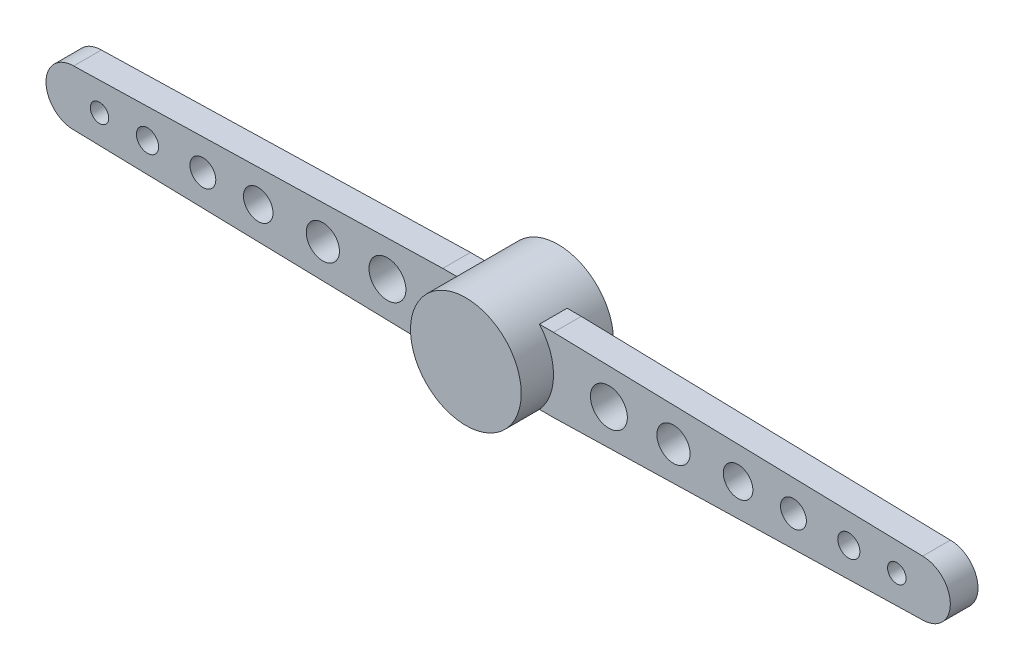
ISO-10303-21;
HEADER;
FILE_DESCRIPTION(('STEP AP214'),'2;1');
FILE_NAME('part.step','',(''),(''),'','','');
FILE_SCHEMA(('AUTOMOTIVE_DESIGN { 1 0 10303 214 1 1 1 1 }'));
ENDSEC;
DATA;
#1=APPLICATION_CONTEXT('core data for automotive mechanical design processes');
#2=APPLICATION_PROTOCOL_DEFINITION('international standard','automotive_design',2000,#1);
#3=PRODUCT_CONTEXT('',#1,'mechanical');
#4=PRODUCT('Part','Part','',(#3));
#5=PRODUCT_RELATED_PRODUCT_CATEGORY('part','',(#4));
#6=PRODUCT_DEFINITION_FORMATION('','',#4);
#7=PRODUCT_DEFINITION_CONTEXT('part definition',#1,'design');
#8=PRODUCT_DEFINITION('design','',#6,#7);
#9=PRODUCT_DEFINITION_SHAPE('','',#8);
#10=(LENGTH_UNIT() NAMED_UNIT(*) SI_UNIT(.MILLI.,.METRE.));
#11=(NAMED_UNIT(*) PLANE_ANGLE_UNIT() SI_UNIT($,.RADIAN.));
#12=(NAMED_UNIT(*) SI_UNIT($,.STERADIAN.) SOLID_ANGLE_UNIT());
#13=UNCERTAINTY_MEASURE_WITH_UNIT(LENGTH_MEASURE(1.E-05),#10,'distance_accuracy_value','');
#14=(GEOMETRIC_REPRESENTATION_CONTEXT(3) GLOBAL_UNCERTAINTY_ASSIGNED_CONTEXT((#13)) GLOBAL_UNIT_ASSIGNED_CONTEXT((#10,
#11,#12)) REPRESENTATION_CONTEXT('',''));
#15=CARTESIAN_POINT('',(0.,0.,0.));
#16=DIRECTION('',(0.,0.,1.));
#17=DIRECTION('',(1.,0.,0.));
#18=AXIS2_PLACEMENT_3D('',#15,#16,#17);
#19=CARTESIAN_POINT('',(0.,0.,2.5));
#20=DIRECTION('',(0.,0.,-1.));
#21=DIRECTION('',(-1.,0.,0.));
#22=AXIS2_PLACEMENT_3D('',#19,#20,#21);
#23=CYLINDRICAL_SURFACE('',#22,1.5);
#24=CARTESIAN_POINT('',(0.,0.,0.));
#25=DIRECTION('',(0.,0.,1.));
#26=DIRECTION('',(1.,0.,0.));
#27=AXIS2_PLACEMENT_3D('',#24,#25,#26);
#28=CIRCLE('',#27,1.5);
#29=CARTESIAN_POINT('',(1.5,0.,0.));
#30=VERTEX_POINT('',#29);
#31=EDGE_CURVE('E182',#30,#30,#28,.T.);
#32=ORIENTED_EDGE('',*,*,#31,.T.);
#33=EDGE_LOOP('',(#32));
#34=FACE_BOUND('',#33,.T.);
#35=CARTESIAN_POINT('',(0.,0.,2.5));
#36=DIRECTION('',(0.,0.,1.));
#37=DIRECTION('',(1.,0.,0.));
#38=AXIS2_PLACEMENT_3D('',#35,#36,#37);
#39=CIRCLE('',#38,1.5);
#40=CARTESIAN_POINT('',(1.5,0.,2.5));
#41=VERTEX_POINT('',#40);
#42=EDGE_CURVE('E185',#41,#41,#39,.T.);
#43=ORIENTED_EDGE('',*,*,#42,.F.);
#44=EDGE_LOOP('',(#43));
#45=FACE_BOUND('',#44,.T.);
#46=CARTESIAN_POINT('',(0.,0.,1.625));
#47=DIRECTION('',(0.,0.,1.));
#48=DIRECTION('',(1.,0.,0.));
#49=AXIS2_PLACEMENT_3D('',#46,#47,#48);
#50=CIRCLE('',#49,1.5);
#51=CARTESIAN_POINT('',(-1.1180339887499,-1.,1.625));
#52=VERTEX_POINT('',#51);
#53=CARTESIAN_POINT('',(-1.1180339887499,1.,1.625));
#54=VERTEX_POINT('',#53);
#55=EDGE_CURVE('E168',#52,#54,#50,.F.);
#56=ORIENTED_EDGE('',*,*,#55,.F.);
#57=DIRECTION('',(0.,0.,-1.));
#58=VECTOR('',#57,1.);
#59=CARTESIAN_POINT('',(-1.1180339887499,-1.,2.5));
#60=LINE('',#59,#58);
#61=CARTESIAN_POINT('',(-1.1180339887499,-1.,0.875));
#62=VERTEX_POINT('',#61);
#63=EDGE_CURVE('E139',#62,#52,#60,.F.);
#64=ORIENTED_EDGE('',*,*,#63,.F.);
#65=CARTESIAN_POINT('',(0.,0.,0.875));
#66=DIRECTION('',(0.,0.,-1.));
#67=DIRECTION('',(-1.,0.,0.));
#68=AXIS2_PLACEMENT_3D('',#65,#66,#67);
#69=CIRCLE('',#68,1.5);
#70=CARTESIAN_POINT('',(-1.1180339887499,1.,0.875));
#71=VERTEX_POINT('',#70);
#72=EDGE_CURVE('E146',#71,#62,#69,.F.);
#73=ORIENTED_EDGE('',*,*,#72,.F.);
#74=DIRECTION('',(0.,0.,-1.));
#75=VECTOR('',#74,1.);
#76=CARTESIAN_POINT('',(-1.1180339887499,1.,2.5));
#77=LINE('',#76,#75);
#78=EDGE_CURVE('E175',#54,#71,#77,.T.);
#79=ORIENTED_EDGE('',*,*,#78,.F.);
#80=EDGE_LOOP('',(#56,#64,#73,#79));
#81=FACE_BOUND('',#80,.T.);
#82=DIRECTION('',(0.,0.,-1.));
#83=VECTOR('',#82,1.);
#84=CARTESIAN_POINT('',(1.1180339887499,1.,2.5));
#85=LINE('',#84,#83);
#86=CARTESIAN_POINT('',(1.1180339887499,1.,1.625));
#87=VERTEX_POINT('',#86);
#88=CARTESIAN_POINT('',(1.1180339887499,1.,0.875));
#89=VERTEX_POINT('',#88);
#90=EDGE_CURVE('E151',#87,#89,#85,.T.);
#91=ORIENTED_EDGE('',*,*,#90,.T.);
#92=CARTESIAN_POINT('',(0.,0.,0.875));
#93=DIRECTION('',(0.,0.,1.));
#94=DIRECTION('',(1.,0.,0.));
#95=AXIS2_PLACEMENT_3D('',#92,#93,#94);
#96=CIRCLE('',#95,1.5);
#97=CARTESIAN_POINT('',(1.1180339887499,-1.,0.875));
#98=VERTEX_POINT('',#97);
#99=EDGE_CURVE('E53',#89,#98,#96,.F.);
#100=ORIENTED_EDGE('',*,*,#99,.T.);
#101=DIRECTION('',(0.,0.,-1.));
#102=VECTOR('',#101,1.);
#103=CARTESIAN_POINT('',(1.1180339887499,-1.,2.5));
#104=LINE('',#103,#102);
#105=CARTESIAN_POINT('',(1.1180339887499,-1.,1.625));
#106=VERTEX_POINT('',#105);
#107=EDGE_CURVE('E193',#98,#106,#104,.F.);
#108=ORIENTED_EDGE('',*,*,#107,.T.);
#109=CARTESIAN_POINT('',(0.,0.,1.625));
#110=DIRECTION('',(0.,0.,-1.));
#111=DIRECTION('',(-1.,0.,0.));
#112=AXIS2_PLACEMENT_3D('',#109,#110,#111);
#113=CIRCLE('',#112,1.5);
#114=EDGE_CURVE('E60',#106,#87,#113,.F.);
#115=ORIENTED_EDGE('',*,*,#114,.T.);
#116=EDGE_LOOP('',(#91,#100,#108,#115));
#117=FACE_BOUND('',#116,.T.);
#118=ADVANCED_FACE('F36',(#34,#45,#81,#117),#23,.T.);
#119=CARTESIAN_POINT('',(1.5,-1.,1.625));
#120=DIRECTION('',(0.024992191160203,-0.999687646408123,0.));
#121=DIRECTION('',(0.999687646408123,0.024992191160203,0.));
#122=AXIS2_PLACEMENT_3D('',#119,#120,#121);
#123=PLANE('',#122);
#124=DIRECTION('',(0.,0.,-1.));
#125=VECTOR('',#124,1.);
#126=CARTESIAN_POINT('',(1.5,-1.,1.625));
#127=LINE('',#126,#125);
#128=CARTESIAN_POINT('',(1.5,-1.,1.625));
#129=VERTEX_POINT('',#128);
#130=CARTESIAN_POINT('',(1.5,-1.,0.875));
#131=VERTEX_POINT('',#130);
#132=EDGE_CURVE('E11',#129,#131,#127,.T.);
#133=ORIENTED_EDGE('',*,*,#132,.T.);
#134=DIRECTION('',(-0.999687646408123,-0.024992191160203,0.));
#135=VECTOR('',#134,1.);
#136=CARTESIAN_POINT('',(1.5,-1.,0.875));
#137=LINE('',#136,#135);
#138=CARTESIAN_POINT('',(11.5,-0.75,0.875));
#139=VERTEX_POINT('',#138);
#140=EDGE_CURVE('E204',#139,#131,#137,.T.);
#141=ORIENTED_EDGE('',*,*,#140,.F.);
#142=DIRECTION('',(0.,0.,-1.));
#143=VECTOR('',#142,1.);
#144=CARTESIAN_POINT('',(11.5,-0.75,1.625));
#145=LINE('',#144,#143);
#146=CARTESIAN_POINT('',(11.5,-0.75,1.625));
#147=VERTEX_POINT('',#146);
#148=EDGE_CURVE('E45',#147,#139,#145,.T.);
#149=ORIENTED_EDGE('',*,*,#148,.F.);
#150=DIRECTION('',(-0.999687646408123,-0.024992191160203,0.));
#151=VECTOR('',#150,1.);
#152=CARTESIAN_POINT('',(1.5,-1.,1.625));
#153=LINE('',#152,#151);
#154=EDGE_CURVE('E213',#147,#129,#153,.T.);
#155=ORIENTED_EDGE('',*,*,#154,.T.);
#156=EDGE_LOOP('',(#133,#141,#149,#155));
#157=FACE_BOUND('',#156,.T.);
#158=ADVANCED_FACE('F237',(#157),#123,.T.);
#159=CARTESIAN_POINT('',(11.5,0.,1.625));
#160=DIRECTION('',(0.,0.,-1.));
#161=DIRECTION('',(-1.,0.,0.));
#162=AXIS2_PLACEMENT_3D('',#159,#160,#161);
#163=CYLINDRICAL_SURFACE('',#162,0.75);
#164=ORIENTED_EDGE('',*,*,#148,.T.);
#165=CARTESIAN_POINT('',(11.5,0.,0.875));
#166=DIRECTION('',(0.,0.,-1.));
#167=DIRECTION('',(1.,0.,0.));
#168=AXIS2_PLACEMENT_3D('',#165,#166,#167);
#169=CIRCLE('',#168,0.75);
#170=CARTESIAN_POINT('',(11.5,0.75,0.875));
#171=VERTEX_POINT('',#170);
#172=EDGE_CURVE('E201',#171,#139,#169,.T.);
#173=ORIENTED_EDGE('',*,*,#172,.F.);
#174=DIRECTION('',(0.,0.,-1.));
#175=VECTOR('',#174,1.);
#176=CARTESIAN_POINT('',(11.5,0.75,1.625));
#177=LINE('',#176,#175);
#178=CARTESIAN_POINT('',(11.5,0.75,1.625));
#179=VERTEX_POINT('',#178);
#180=EDGE_CURVE('E216',#179,#171,#177,.T.);
#181=ORIENTED_EDGE('',*,*,#180,.F.);
#182=CARTESIAN_POINT('',(11.5,0.,1.625));
#183=DIRECTION('',(0.,0.,-1.));
#184=DIRECTION('',(1.,0.,0.));
#185=AXIS2_PLACEMENT_3D('',#182,#183,#184);
#186=CIRCLE('',#185,0.75);
#187=EDGE_CURVE('E210',#179,#147,#186,.T.);
#188=ORIENTED_EDGE('',*,*,#187,.T.);
#189=EDGE_LOOP('',(#164,#173,#181,#188));
#190=FACE_BOUND('',#189,.T.);
#191=ADVANCED_FACE('F232',(#190),#163,.T.);
#192=CARTESIAN_POINT('',(1.5,1.,1.625));
#193=DIRECTION('',(0.024992191160203,0.999687646408123,0.));
#194=DIRECTION('',(-0.999687646408123,0.024992191160203,0.));
#195=AXIS2_PLACEMENT_3D('',#192,#193,#194);
#196=PLANE('',#195);
#197=ORIENTED_EDGE('',*,*,#180,.T.);
#198=DIRECTION('',(0.999687646408123,-0.024992191160203,0.));
#199=VECTOR('',#198,1.);
#200=CARTESIAN_POINT('',(1.5,1.,0.875));
#201=LINE('',#200,#199);
#202=CARTESIAN_POINT('',(1.5,1.,0.875));
#203=VERTEX_POINT('',#202);
#204=EDGE_CURVE('E192',#203,#171,#201,.T.);
#205=ORIENTED_EDGE('',*,*,#204,.F.);
#206=DIRECTION('',(0.,0.,-1.));
#207=VECTOR('',#206,1.);
#208=CARTESIAN_POINT('',(1.5,1.,1.625));
#209=LINE('',#208,#207);
#210=CARTESIAN_POINT('',(1.5,1.,1.625));
#211=VERTEX_POINT('',#210);
#212=EDGE_CURVE('E40',#211,#203,#209,.T.);
#213=ORIENTED_EDGE('',*,*,#212,.F.);
#214=DIRECTION('',(0.999687646408123,-0.024992191160203,0.));
#215=VECTOR('',#214,1.);
#216=CARTESIAN_POINT('',(1.5,1.,1.625));
#217=LINE('',#216,#215);
#218=EDGE_CURVE('E207',#211,#179,#217,.T.);
#219=ORIENTED_EDGE('',*,*,#218,.T.);
#220=EDGE_LOOP('',(#197,#205,#213,#219));
#221=FACE_BOUND('',#220,.T.);
#222=ADVANCED_FACE('F38',(#221),#196,.T.);
#223=CARTESIAN_POINT('',(11.5,0.,1.625));
#224=DIRECTION('',(0.,0.,1.));
#225=DIRECTION('',(1.,0.,0.));
#226=AXIS2_PLACEMENT_3D('',#223,#224,#225);
#227=PLANE('',#226);
#228=CARTESIAN_POINT('',(3.,0.,1.625));
#229=DIRECTION('',(0.,0.,1.));
#230=DIRECTION('',(-1.,0.,0.));
#231=AXIS2_PLACEMENT_3D('',#228,#229,#230);
#232=CIRCLE('',#231,0.5);
#233=CARTESIAN_POINT('',(2.5,0.,1.625));
#234=VERTEX_POINT('',#233);
#235=EDGE_CURVE('E561',#234,#234,#232,.T.);
#236=ORIENTED_EDGE('',*,*,#235,.F.);
#237=EDGE_LOOP('',(#236));
#238=FACE_BOUND('',#237,.T.);
#239=CARTESIAN_POINT('',(4.75,0.,1.625));
#240=DIRECTION('',(0.,0.,1.));
#241=DIRECTION('',(-1.,0.,0.));
#242=AXIS2_PLACEMENT_3D('',#239,#240,#241);
#243=CIRCLE('',#242,0.45);
#244=CARTESIAN_POINT('',(4.3,0.,1.625));
#245=VERTEX_POINT('',#244);
#246=EDGE_CURVE('E567',#245,#245,#243,.T.);
#247=ORIENTED_EDGE('',*,*,#246,.F.);
#248=EDGE_LOOP('',(#247));
#249=FACE_BOUND('',#248,.T.);
#250=CARTESIAN_POINT('',(6.5,0.,1.625));
#251=DIRECTION('',(0.,0.,1.));
#252=DIRECTION('',(-1.,0.,0.));
#253=AXIS2_PLACEMENT_3D('',#250,#251,#252);
#254=CIRCLE('',#253,0.4);
#255=CARTESIAN_POINT('',(6.1,0.,1.625));
#256=VERTEX_POINT('',#255);
#257=EDGE_CURVE('E573',#256,#256,#254,.T.);
#258=ORIENTED_EDGE('',*,*,#257,.F.);
#259=EDGE_LOOP('',(#258));
#260=FACE_BOUND('',#259,.T.);
#261=CARTESIAN_POINT('',(8.,0.,1.625));
#262=DIRECTION('',(0.,0.,1.));
#263=DIRECTION('',(-1.,0.,0.));
#264=AXIS2_PLACEMENT_3D('',#261,#262,#263);
#265=CIRCLE('',#264,0.349999999999999);
#266=CARTESIAN_POINT('',(7.65,0.,1.625));
#267=VERTEX_POINT('',#266);
#268=EDGE_CURVE('E579',#267,#267,#265,.T.);
#269=ORIENTED_EDGE('',*,*,#268,.F.);
#270=EDGE_LOOP('',(#269));
#271=FACE_BOUND('',#270,.T.);
#272=CARTESIAN_POINT('',(9.5,0.,1.625));
#273=DIRECTION('',(0.,0.,1.));
#274=DIRECTION('',(-1.,0.,0.));
#275=AXIS2_PLACEMENT_3D('',#272,#273,#274);
#276=CIRCLE('',#275,0.3);
#277=CARTESIAN_POINT('',(9.2,0.,1.625));
#278=VERTEX_POINT('',#277);
#279=EDGE_CURVE('E585',#278,#278,#276,.T.);
#280=ORIENTED_EDGE('',*,*,#279,.F.);
#281=EDGE_LOOP('',(#280));
#282=FACE_BOUND('',#281,.T.);
#283=CARTESIAN_POINT('',(10.8,0.,1.625));
#284=DIRECTION('',(0.,0.,1.));
#285=DIRECTION('',(-1.,0.,0.));
#286=AXIS2_PLACEMENT_3D('',#283,#284,#285);
#287=CIRCLE('',#286,0.25);
#288=CARTESIAN_POINT('',(10.55,0.,1.625));
#289=VERTEX_POINT('',#288);
#290=EDGE_CURVE('E589',#289,#289,#287,.T.);
#291=ORIENTED_EDGE('',*,*,#290,.F.);
#292=EDGE_LOOP('',(#291));
#293=FACE_BOUND('',#292,.T.);
#294=ORIENTED_EDGE('',*,*,#218,.F.);
#295=DIRECTION('',(1.,0.,0.));
#296=VECTOR('',#295,1.);
#297=CARTESIAN_POINT('',(-12.251,1.,1.625));
#298=LINE('',#297,#296);
#299=EDGE_CURVE('E225',#87,#211,#298,.T.);
#300=ORIENTED_EDGE('',*,*,#299,.F.);
#301=ORIENTED_EDGE('',*,*,#114,.F.);
#302=DIRECTION('',(1.,0.,0.));
#303=VECTOR('',#302,1.);
#304=CARTESIAN_POINT('',(-12.251,-1.,1.625));
#305=LINE('',#304,#303);
#306=EDGE_CURVE('E196',#106,#129,#305,.T.);
#307=ORIENTED_EDGE('',*,*,#306,.T.);
#308=ORIENTED_EDGE('',*,*,#154,.F.);
#309=ORIENTED_EDGE('',*,*,#187,.F.);
#310=EDGE_LOOP('',(#294,#300,#301,#307,#308,#309));
#311=FACE_BOUND('',#310,.T.);
#312=ADVANCED_FACE('F229',(#238,#249,#260,#271,#282,#293,#311),#227,.T.);
#313=CARTESIAN_POINT('',(11.5,0.,0.875));
#314=DIRECTION('',(0.,0.,1.));
#315=DIRECTION('',(1.,0.,0.));
#316=AXIS2_PLACEMENT_3D('',#313,#314,#315);
#317=PLANE('',#316);
#318=CARTESIAN_POINT('',(3.,0.,0.875));
#319=DIRECTION('',(0.,0.,1.));
#320=DIRECTION('',(1.,0.,0.));
#321=AXIS2_PLACEMENT_3D('',#318,#319,#320);
#322=CIRCLE('',#321,0.5);
#323=CARTESIAN_POINT('',(3.5,0.,0.875));
#324=VERTEX_POINT('',#323);
#325=EDGE_CURVE('E556',#324,#324,#322,.F.);
#326=ORIENTED_EDGE('',*,*,#325,.F.);
#327=EDGE_LOOP('',(#326));
#328=FACE_BOUND('',#327,.T.);
#329=CARTESIAN_POINT('',(4.75,0.,0.875));
#330=DIRECTION('',(0.,0.,1.));
#331=DIRECTION('',(1.,0.,0.));
#332=AXIS2_PLACEMENT_3D('',#329,#330,#331);
#333=CIRCLE('',#332,0.45);
#334=CARTESIAN_POINT('',(5.2,0.,0.875));
#335=VERTEX_POINT('',#334);
#336=EDGE_CURVE('E565',#335,#335,#333,.F.);
#337=ORIENTED_EDGE('',*,*,#336,.F.);
#338=EDGE_LOOP('',(#337));
#339=FACE_BOUND('',#338,.T.);
#340=CARTESIAN_POINT('',(6.5,0.,0.875));
#341=DIRECTION('',(0.,0.,1.));
#342=DIRECTION('',(1.,0.,0.));
#343=AXIS2_PLACEMENT_3D('',#340,#341,#342);
#344=CIRCLE('',#343,0.4);
#345=CARTESIAN_POINT('',(6.9,0.,0.875));
#346=VERTEX_POINT('',#345);
#347=EDGE_CURVE('E570',#346,#346,#344,.F.);
#348=ORIENTED_EDGE('',*,*,#347,.F.);
#349=EDGE_LOOP('',(#348));
#350=FACE_BOUND('',#349,.T.);
#351=CARTESIAN_POINT('',(8.,0.,0.875));
#352=DIRECTION('',(0.,0.,1.));
#353=DIRECTION('',(1.,0.,0.));
#354=AXIS2_PLACEMENT_3D('',#351,#352,#353);
#355=CIRCLE('',#354,0.349999999999999);
#356=CARTESIAN_POINT('',(8.35,0.,0.875));
#357=VERTEX_POINT('',#356);
#358=EDGE_CURVE('E576',#357,#357,#355,.F.);
#359=ORIENTED_EDGE('',*,*,#358,.F.);
#360=EDGE_LOOP('',(#359));
#361=FACE_BOUND('',#360,.T.);
#362=CARTESIAN_POINT('',(9.5,0.,0.875));
#363=DIRECTION('',(0.,0.,1.));
#364=DIRECTION('',(1.,0.,0.));
#365=AXIS2_PLACEMENT_3D('',#362,#363,#364);
#366=CIRCLE('',#365,0.3);
#367=CARTESIAN_POINT('',(9.8,0.,0.875));
#368=VERTEX_POINT('',#367);
#369=EDGE_CURVE('E582',#368,#368,#366,.F.);
#370=ORIENTED_EDGE('',*,*,#369,.F.);
#371=EDGE_LOOP('',(#370));
#372=FACE_BOUND('',#371,.T.);
#373=CARTESIAN_POINT('',(10.8,0.,0.875));
#374=DIRECTION('',(0.,0.,1.));
#375=DIRECTION('',(1.,0.,0.));
#376=AXIS2_PLACEMENT_3D('',#373,#374,#375);
#377=CIRCLE('',#376,0.25);
#378=CARTESIAN_POINT('',(11.05,0.,0.875));
#379=VERTEX_POINT('',#378);
#380=EDGE_CURVE('E247',#379,#379,#377,.F.);
#381=ORIENTED_EDGE('',*,*,#380,.F.);
#382=EDGE_LOOP('',(#381));
#383=FACE_BOUND('',#382,.T.);
#384=ORIENTED_EDGE('',*,*,#140,.T.);
#385=DIRECTION('',(1.,0.,0.));
#386=VECTOR('',#385,1.);
#387=CARTESIAN_POINT('',(-12.251,-1.,0.875));
#388=LINE('',#387,#386);
#389=EDGE_CURVE('E188',#98,#131,#388,.T.);
#390=ORIENTED_EDGE('',*,*,#389,.F.);
#391=ORIENTED_EDGE('',*,*,#99,.F.);
#392=DIRECTION('',(1.,0.,0.));
#393=VECTOR('',#392,1.);
#394=CARTESIAN_POINT('',(-12.251,1.,0.875));
#395=LINE('',#394,#393);
#396=EDGE_CURVE('E224',#89,#203,#395,.T.);
#397=ORIENTED_EDGE('',*,*,#396,.T.);
#398=ORIENTED_EDGE('',*,*,#204,.T.);
#399=ORIENTED_EDGE('',*,*,#172,.T.);
#400=EDGE_LOOP('',(#384,#390,#391,#397,#398,#399));
#401=FACE_BOUND('',#400,.T.);
#402=ADVANCED_FACE('F235',(#328,#339,#350,#361,#372,#383,#401),#317,.F.);
#403=CARTESIAN_POINT('',(-12.251,-1.,0.875));
#404=DIRECTION('',(0.,1.,0.));
#405=DIRECTION('',(0.,0.,1.));
#406=AXIS2_PLACEMENT_3D('',#403,#404,#405);
#407=PLANE('',#406);
#408=ORIENTED_EDGE('',*,*,#107,.F.);
#409=ORIENTED_EDGE('',*,*,#389,.T.);
#410=ORIENTED_EDGE('',*,*,#132,.F.);
#411=ORIENTED_EDGE('',*,*,#306,.F.);
#412=EDGE_LOOP('',(#408,#409,#410,#411));
#413=FACE_BOUND('',#412,.T.);
#414=ADVANCED_FACE('F242',(#413),#407,.F.);
#415=CARTESIAN_POINT('',(0.,0.,2.5));
#416=DIRECTION('',(0.,0.,1.));
#417=DIRECTION('',(1.,0.,0.));
#418=AXIS2_PLACEMENT_3D('',#415,#416,#417);
#419=PLANE('',#418);
#420=ORIENTED_EDGE('',*,*,#42,.T.);
#421=EDGE_LOOP('',(#420));
#422=FACE_BOUND('',#421,.T.);
#423=ADVANCED_FACE('F303',(#422),#419,.T.);
#424=CARTESIAN_POINT('',(0.,0.,0.));
#425=DIRECTION('',(0.,0.,1.));
#426=DIRECTION('',(1.,0.,0.));
#427=AXIS2_PLACEMENT_3D('',#424,#425,#426);
#428=PLANE('',#427);
#429=CARTESIAN_POINT('',(0.,0.,0.));
#430=DIRECTION('',(0.,0.,1.));
#431=DIRECTION('',(1.,0.,0.));
#432=AXIS2_PLACEMENT_3D('',#429,#430,#431);
#433=CIRCLE('',#432,1.);
#434=CARTESIAN_POINT('',(1.,0.,0.));
#435=VERTEX_POINT('',#434);
#436=EDGE_CURVE('E173',#435,#435,#433,.T.);
#437=ORIENTED_EDGE('',*,*,#436,.T.);
#438=EDGE_LOOP('',(#437));
#439=FACE_BOUND('',#438,.T.);
#440=ORIENTED_EDGE('',*,*,#31,.F.);
#441=EDGE_LOOP('',(#440));
#442=FACE_BOUND('',#441,.T.);
#443=ADVANCED_FACE('F299',(#439,#442),#428,.F.);
#444=CARTESIAN_POINT('',(0.,0.,2.));
#445=DIRECTION('',(0.,0.,-1.));
#446=DIRECTION('',(-1.,0.,0.));
#447=AXIS2_PLACEMENT_3D('',#444,#445,#446);
#448=CYLINDRICAL_SURFACE('',#447,1.);
#449=CARTESIAN_POINT('',(0.,0.,2.));
#450=DIRECTION('',(0.,0.,1.));
#451=DIRECTION('',(1.,0.,0.));
#452=AXIS2_PLACEMENT_3D('',#449,#450,#451);
#453=CIRCLE('',#452,1.);
#454=CARTESIAN_POINT('',(1.,0.,2.));
#455=VERTEX_POINT('',#454);
#456=EDGE_CURVE('E179',#455,#455,#453,.T.);
#457=ORIENTED_EDGE('',*,*,#456,.T.);
#458=EDGE_LOOP('',(#457));
#459=FACE_BOUND('',#458,.T.);
#460=ORIENTED_EDGE('',*,*,#436,.F.);
#461=EDGE_LOOP('',(#460));
#462=FACE_BOUND('',#461,.T.);
#463=ADVANCED_FACE('F283',(#459,#462),#448,.F.);
#464=CARTESIAN_POINT('',(0.,0.,2.));
#465=DIRECTION('',(0.,0.,1.));
#466=DIRECTION('',(1.,0.,0.));
#467=AXIS2_PLACEMENT_3D('',#464,#465,#466);
#468=PLANE('',#467);
#469=ORIENTED_EDGE('',*,*,#456,.F.);
#470=EDGE_LOOP('',(#469));
#471=FACE_BOUND('',#470,.T.);
#472=ADVANCED_FACE('F275',(#471),#468,.F.);
#473=CARTESIAN_POINT('',(12.251,-1.,1.625));
#474=DIRECTION('',(0.,0.,1.));
#475=DIRECTION('',(1.,0.,0.));
#476=AXIS2_PLACEMENT_3D('',#473,#474,#475);
#477=PLANE('',#476);
#478=CARTESIAN_POINT('',(-10.8,0.,1.625));
#479=DIRECTION('',(0.,0.,1.));
#480=DIRECTION('',(1.,0.,0.));
#481=AXIS2_PLACEMENT_3D('',#478,#479,#480);
#482=CIRCLE('',#481,0.25);
#483=CARTESIAN_POINT('',(-10.55,0.,1.625));
#484=VERTEX_POINT('',#483);
#485=EDGE_CURVE('E249',#484,#484,#482,.T.);
#486=ORIENTED_EDGE('',*,*,#485,.F.);
#487=EDGE_LOOP('',(#486));
#488=FACE_BOUND('',#487,.T.);
#489=CARTESIAN_POINT('',(-9.5,0.,1.625));
#490=DIRECTION('',(0.,0.,1.));
#491=DIRECTION('',(1.,0.,0.));
#492=AXIS2_PLACEMENT_3D('',#489,#490,#491);
#493=CIRCLE('',#492,0.3);
#494=CARTESIAN_POINT('',(-9.2,0.,1.625));
#495=VERTEX_POINT('',#494);
#496=EDGE_CURVE('E631',#495,#495,#493,.T.);
#497=ORIENTED_EDGE('',*,*,#496,.F.);
#498=EDGE_LOOP('',(#497));
#499=FACE_BOUND('',#498,.T.);
#500=CARTESIAN_POINT('',(-8.,0.,1.625));
#501=DIRECTION('',(0.,0.,1.));
#502=DIRECTION('',(1.,0.,0.));
#503=AXIS2_PLACEMENT_3D('',#500,#501,#502);
#504=CIRCLE('',#503,0.349999999999999);
#505=CARTESIAN_POINT('',(-7.65,0.,1.625));
#506=VERTEX_POINT('',#505);
#507=EDGE_CURVE('E627',#506,#506,#504,.T.);
#508=ORIENTED_EDGE('',*,*,#507,.F.);
#509=EDGE_LOOP('',(#508));
#510=FACE_BOUND('',#509,.T.);
#511=CARTESIAN_POINT('',(-6.5,0.,1.625));
#512=DIRECTION('',(0.,0.,1.));
#513=DIRECTION('',(1.,0.,0.));
#514=AXIS2_PLACEMENT_3D('',#511,#512,#513);
#515=CIRCLE('',#514,0.4);
#516=CARTESIAN_POINT('',(-6.1,0.,1.625));
#517=VERTEX_POINT('',#516);
#518=EDGE_CURVE('E623',#517,#517,#515,.T.);
#519=ORIENTED_EDGE('',*,*,#518,.F.);
#520=EDGE_LOOP('',(#519));
#521=FACE_BOUND('',#520,.T.);
#522=CARTESIAN_POINT('',(-4.75,0.,1.625));
#523=DIRECTION('',(0.,0.,1.));
#524=DIRECTION('',(1.,0.,0.));
#525=AXIS2_PLACEMENT_3D('',#522,#523,#524);
#526=CIRCLE('',#525,0.45);
#527=CARTESIAN_POINT('',(-4.3,0.,1.625));
#528=VERTEX_POINT('',#527);
#529=EDGE_CURVE('E619',#528,#528,#526,.T.);
#530=ORIENTED_EDGE('',*,*,#529,.F.);
#531=EDGE_LOOP('',(#530));
#532=FACE_BOUND('',#531,.T.);
#533=CARTESIAN_POINT('',(-3.,0.,1.625));
#534=DIRECTION('',(0.,0.,1.));
#535=DIRECTION('',(1.,0.,0.));
#536=AXIS2_PLACEMENT_3D('',#533,#534,#535);
#537=CIRCLE('',#536,0.5);
#538=CARTESIAN_POINT('',(-2.5,0.,1.625));
#539=VERTEX_POINT('',#538);
#540=EDGE_CURVE('E555',#539,#539,#537,.T.);
#541=ORIENTED_EDGE('',*,*,#540,.F.);
#542=EDGE_LOOP('',(#541));
#543=FACE_BOUND('',#542,.T.);
#544=DIRECTION('',(-1.,0.,0.));
#545=VECTOR('',#544,1.);
#546=CARTESIAN_POINT('',(12.251,1.,1.625));
#547=LINE('',#546,#545);
#548=CARTESIAN_POINT('',(-1.5,1.,1.625));
#549=VERTEX_POINT('',#548);
#550=EDGE_CURVE('E171',#54,#549,#547,.T.);
#551=ORIENTED_EDGE('',*,*,#550,.T.);
#552=DIRECTION('',(0.999687646408123,0.024992191160203,0.));
#553=VECTOR('',#552,1.);
#554=CARTESIAN_POINT('',(-1.5,1.,1.625));
#555=LINE('',#554,#553);
#556=CARTESIAN_POINT('',(-11.5,0.75,1.625));
#557=VERTEX_POINT('',#556);
#558=EDGE_CURVE('E156',#557,#549,#555,.T.);
#559=ORIENTED_EDGE('',*,*,#558,.F.);
#560=CARTESIAN_POINT('',(-11.5,0.,1.625));
#561=DIRECTION('',(0.,0.,-1.));
#562=DIRECTION('',(-1.,0.,0.));
#563=AXIS2_PLACEMENT_3D('',#560,#561,#562);
#564=CIRCLE('',#563,0.75);
#565=CARTESIAN_POINT('',(-11.5,-0.75,1.625));
#566=VERTEX_POINT('',#565);
#567=EDGE_CURVE('E161',#566,#557,#564,.T.);
#568=ORIENTED_EDGE('',*,*,#567,.F.);
#569=DIRECTION('',(-0.999687646408123,0.024992191160203,0.));
#570=VECTOR('',#569,1.);
#571=CARTESIAN_POINT('',(-1.5,-1.,1.625));
#572=LINE('',#571,#570);
#573=CARTESIAN_POINT('',(-1.5,-1.,1.625));
#574=VERTEX_POINT('',#573);
#575=EDGE_CURVE('E257',#574,#566,#572,.T.);
#576=ORIENTED_EDGE('',*,*,#575,.F.);
#577=DIRECTION('',(-1.,0.,0.));
#578=VECTOR('',#577,1.);
#579=CARTESIAN_POINT('',(12.251,-1.,1.625));
#580=LINE('',#579,#578);
#581=EDGE_CURVE('E150',#52,#574,#580,.T.);
#582=ORIENTED_EDGE('',*,*,#581,.F.);
#583=ORIENTED_EDGE('',*,*,#55,.T.);
#584=EDGE_LOOP('',(#551,#559,#568,#576,#582,#583));
#585=FACE_BOUND('',#584,.T.);
#586=ADVANCED_FACE('F273',(#488,#499,#510,#521,#532,#543,#585),#477,.T.);
#587=CARTESIAN_POINT('',(12.251,1.,1.625));
#588=DIRECTION('',(0.,1.,0.));
#589=DIRECTION('',(0.,0.,1.));
#590=AXIS2_PLACEMENT_3D('',#587,#588,#589);
#591=PLANE('',#590);
#592=ORIENTED_EDGE('',*,*,#550,.F.);
#593=ORIENTED_EDGE('',*,*,#78,.T.);
#594=DIRECTION('',(-1.,0.,0.));
#595=VECTOR('',#594,1.);
#596=CARTESIAN_POINT('',(12.251,1.,0.875));
#597=LINE('',#596,#595);
#598=CARTESIAN_POINT('',(-1.5,1.,0.875));
#599=VERTEX_POINT('',#598);
#600=EDGE_CURVE('E174',#71,#599,#597,.T.);
#601=ORIENTED_EDGE('',*,*,#600,.T.);
#602=DIRECTION('',(0.,0.,-1.));
#603=VECTOR('',#602,1.);
#604=CARTESIAN_POINT('',(-1.5,1.,1.625));
#605=LINE('',#604,#603);
#606=EDGE_CURVE('E165',#549,#599,#605,.T.);
#607=ORIENTED_EDGE('',*,*,#606,.F.);
#608=EDGE_LOOP('',(#592,#593,#601,#607));
#609=FACE_BOUND('',#608,.T.);
#610=ADVANCED_FACE('F269',(#609),#591,.T.);
#611=CARTESIAN_POINT('',(12.251,-1.,0.875));
#612=DIRECTION('',(0.,0.,-1.));
#613=DIRECTION('',(-1.,0.,0.));
#614=AXIS2_PLACEMENT_3D('',#611,#612,#613);
#615=PLANE('',#614);
#616=CARTESIAN_POINT('',(-10.8,0.,0.875));
#617=DIRECTION('',(0.,0.,-1.));
#618=DIRECTION('',(-1.,0.,0.));
#619=AXIS2_PLACEMENT_3D('',#616,#617,#618);
#620=CIRCLE('',#619,0.25);
#621=CARTESIAN_POINT('',(-11.05,0.,0.875));
#622=VERTEX_POINT('',#621);
#623=EDGE_CURVE('E535',#622,#622,#620,.F.);
#624=ORIENTED_EDGE('',*,*,#623,.T.);
#625=EDGE_LOOP('',(#624));
#626=FACE_BOUND('',#625,.T.);
#627=CARTESIAN_POINT('',(-9.5,0.,0.875));
#628=DIRECTION('',(0.,0.,-1.));
#629=DIRECTION('',(-1.,0.,0.));
#630=AXIS2_PLACEMENT_3D('',#627,#628,#629);
#631=CIRCLE('',#630,0.3);
#632=CARTESIAN_POINT('',(-9.8,0.,0.875));
#633=VERTEX_POINT('',#632);
#634=EDGE_CURVE('E539',#633,#633,#631,.F.);
#635=ORIENTED_EDGE('',*,*,#634,.T.);
#636=EDGE_LOOP('',(#635));
#637=FACE_BOUND('',#636,.T.);
#638=CARTESIAN_POINT('',(-8.,0.,0.875));
#639=DIRECTION('',(0.,0.,-1.));
#640=DIRECTION('',(-1.,0.,0.));
#641=AXIS2_PLACEMENT_3D('',#638,#639,#640);
#642=CIRCLE('',#641,0.349999999999999);
#643=CARTESIAN_POINT('',(-8.35,0.,0.875));
#644=VERTEX_POINT('',#643);
#645=EDGE_CURVE('E543',#644,#644,#642,.F.);
#646=ORIENTED_EDGE('',*,*,#645,.T.);
#647=EDGE_LOOP('',(#646));
#648=FACE_BOUND('',#647,.T.);
#649=CARTESIAN_POINT('',(-6.5,0.,0.875));
#650=DIRECTION('',(0.,0.,-1.));
#651=DIRECTION('',(-1.,0.,0.));
#652=AXIS2_PLACEMENT_3D('',#649,#650,#651);
#653=CIRCLE('',#652,0.4);
#654=CARTESIAN_POINT('',(-6.9,0.,0.875));
#655=VERTEX_POINT('',#654);
#656=EDGE_CURVE('E547',#655,#655,#653,.F.);
#657=ORIENTED_EDGE('',*,*,#656,.T.);
#658=EDGE_LOOP('',(#657));
#659=FACE_BOUND('',#658,.T.);
#660=CARTESIAN_POINT('',(-4.75,0.,0.875));
#661=DIRECTION('',(0.,0.,-1.));
#662=DIRECTION('',(-1.,0.,0.));
#663=AXIS2_PLACEMENT_3D('',#660,#661,#662);
#664=CIRCLE('',#663,0.45);
#665=CARTESIAN_POINT('',(-5.2,0.,0.875));
#666=VERTEX_POINT('',#665);
#667=EDGE_CURVE('E551',#666,#666,#664,.F.);
#668=ORIENTED_EDGE('',*,*,#667,.T.);
#669=EDGE_LOOP('',(#668));
#670=FACE_BOUND('',#669,.T.);
#671=CARTESIAN_POINT('',(-3.,0.,0.875));
#672=DIRECTION('',(0.,0.,-1.));
#673=DIRECTION('',(-1.,0.,0.));
#674=AXIS2_PLACEMENT_3D('',#671,#672,#673);
#675=CIRCLE('',#674,0.5);
#676=CARTESIAN_POINT('',(-3.5,0.,0.875));
#677=VERTEX_POINT('',#676);
#678=EDGE_CURVE('E554',#677,#677,#675,.F.);
#679=ORIENTED_EDGE('',*,*,#678,.T.);
#680=EDGE_LOOP('',(#679));
#681=FACE_BOUND('',#680,.T.);
#682=ORIENTED_EDGE('',*,*,#600,.F.);
#683=ORIENTED_EDGE('',*,*,#72,.T.);
#684=DIRECTION('',(-1.,0.,0.));
#685=VECTOR('',#684,1.);
#686=CARTESIAN_POINT('',(12.251,-1.,0.875));
#687=LINE('',#686,#685);
#688=CARTESIAN_POINT('',(-1.5,-1.,0.875));
#689=VERTEX_POINT('',#688);
#690=EDGE_CURVE('E142',#62,#689,#687,.T.);
#691=ORIENTED_EDGE('',*,*,#690,.T.);
#692=DIRECTION('',(-0.999687646408123,0.024992191160203,0.));
#693=VECTOR('',#692,1.);
#694=CARTESIAN_POINT('',(-1.5,-1.,0.875));
#695=LINE('',#694,#693);
#696=CARTESIAN_POINT('',(-11.5,-0.75,0.875));
#697=VERTEX_POINT('',#696);
#698=EDGE_CURVE('E127',#689,#697,#695,.T.);
#699=ORIENTED_EDGE('',*,*,#698,.T.);
#700=CARTESIAN_POINT('',(-11.5,0.,0.875));
#701=DIRECTION('',(0.,0.,-1.));
#702=DIRECTION('',(-1.,0.,0.));
#703=AXIS2_PLACEMENT_3D('',#700,#701,#702);
#704=CIRCLE('',#703,0.75);
#705=CARTESIAN_POINT('',(-11.5,0.75,0.875));
#706=VERTEX_POINT('',#705);
#707=EDGE_CURVE('E138',#697,#706,#704,.T.);
#708=ORIENTED_EDGE('',*,*,#707,.T.);
#709=DIRECTION('',(0.999687646408123,0.024992191160203,0.));
#710=VECTOR('',#709,1.);
#711=CARTESIAN_POINT('',(-1.5,1.,0.875));
#712=LINE('',#711,#710);
#713=EDGE_CURVE('E254',#706,#599,#712,.T.);
#714=ORIENTED_EDGE('',*,*,#713,.T.);
#715=EDGE_LOOP('',(#682,#683,#691,#699,#708,#714));
#716=FACE_BOUND('',#715,.T.);
#717=ADVANCED_FACE('F144',(#626,#637,#648,#659,#670,#681,#716),#615,.T.);
#718=CARTESIAN_POINT('',(-1.5,1.,1.625));
#719=DIRECTION('',(-0.024992191160203,0.999687646408123,0.));
#720=DIRECTION('',(-0.999687646408123,-0.024992191160203,0.));
#721=AXIS2_PLACEMENT_3D('',#718,#719,#720);
#722=PLANE('',#721);
#723=ORIENTED_EDGE('',*,*,#606,.T.);
#724=ORIENTED_EDGE('',*,*,#713,.F.);
#725=DIRECTION('',(0.,0.,-1.));
#726=VECTOR('',#725,1.);
#727=CARTESIAN_POINT('',(-11.5,0.75,1.625));
#728=LINE('',#727,#726);
#729=EDGE_CURVE('E158',#557,#706,#728,.T.);
#730=ORIENTED_EDGE('',*,*,#729,.F.);
#731=ORIENTED_EDGE('',*,*,#558,.T.);
#732=EDGE_LOOP('',(#723,#724,#730,#731));
#733=FACE_BOUND('',#732,.T.);
#734=ADVANCED_FACE('F266',(#733),#722,.T.);
#735=CARTESIAN_POINT('',(-11.5,0.,1.625));
#736=DIRECTION('',(0.,0.,-1.));
#737=DIRECTION('',(-1.,0.,0.));
#738=AXIS2_PLACEMENT_3D('',#735,#736,#737);
#739=CYLINDRICAL_SURFACE('',#738,0.75);
#740=ORIENTED_EDGE('',*,*,#729,.T.);
#741=ORIENTED_EDGE('',*,*,#707,.F.);
#742=DIRECTION('',(0.,0.,-1.));
#743=VECTOR('',#742,1.);
#744=CARTESIAN_POINT('',(-11.5,-0.75,1.625));
#745=LINE('',#744,#743);
#746=EDGE_CURVE('E134',#566,#697,#745,.T.);
#747=ORIENTED_EDGE('',*,*,#746,.F.);
#748=ORIENTED_EDGE('',*,*,#567,.T.);
#749=EDGE_LOOP('',(#740,#741,#747,#748));
#750=FACE_BOUND('',#749,.T.);
#751=ADVANCED_FACE('F261',(#750),#739,.T.);
#752=CARTESIAN_POINT('',(-1.5,-1.,1.625));
#753=DIRECTION('',(-0.024992191160203,-0.999687646408123,0.));
#754=DIRECTION('',(0.999687646408123,-0.024992191160203,0.));
#755=AXIS2_PLACEMENT_3D('',#752,#753,#754);
#756=PLANE('',#755);
#757=ORIENTED_EDGE('',*,*,#746,.T.);
#758=ORIENTED_EDGE('',*,*,#698,.F.);
#759=DIRECTION('',(0.,0.,-1.));
#760=VECTOR('',#759,1.);
#761=CARTESIAN_POINT('',(-1.5,-1.,1.625));
#762=LINE('',#761,#760);
#763=EDGE_CURVE('E132',#574,#689,#762,.T.);
#764=ORIENTED_EDGE('',*,*,#763,.F.);
#765=ORIENTED_EDGE('',*,*,#575,.T.);
#766=EDGE_LOOP('',(#757,#758,#764,#765));
#767=FACE_BOUND('',#766,.T.);
#768=ADVANCED_FACE('F129',(#767),#756,.T.);
#769=CARTESIAN_POINT('',(12.251,-1.,1.625));
#770=DIRECTION('',(0.,-1.,0.));
#771=DIRECTION('',(0.,0.,-1.));
#772=AXIS2_PLACEMENT_3D('',#769,#770,#771);
#773=PLANE('',#772);
#774=ORIENTED_EDGE('',*,*,#690,.F.);
#775=ORIENTED_EDGE('',*,*,#63,.T.);
#776=ORIENTED_EDGE('',*,*,#581,.T.);
#777=ORIENTED_EDGE('',*,*,#763,.T.);
#778=EDGE_LOOP('',(#774,#775,#776,#777));
#779=FACE_BOUND('',#778,.T.);
#780=ADVANCED_FACE('F154',(#779),#773,.T.);
#781=CARTESIAN_POINT('',(-12.251,1.,0.875));
#782=DIRECTION('',(0.,-1.,0.));
#783=DIRECTION('',(0.,0.,-1.));
#784=AXIS2_PLACEMENT_3D('',#781,#782,#783);
#785=PLANE('',#784);
#786=ORIENTED_EDGE('',*,*,#90,.F.);
#787=ORIENTED_EDGE('',*,*,#299,.T.);
#788=ORIENTED_EDGE('',*,*,#212,.T.);
#789=ORIENTED_EDGE('',*,*,#396,.F.);
#790=EDGE_LOOP('',(#786,#787,#788,#789));
#791=FACE_BOUND('',#790,.T.);
#792=ADVANCED_FACE('F223',(#791),#785,.F.);
#793=CARTESIAN_POINT('',(-3.,0.,-0.000999999999999916));
#794=DIRECTION('',(0.,0.,1.));
#795=DIRECTION('',(1.,0.,0.));
#796=AXIS2_PLACEMENT_3D('',#793,#794,#795);
#797=CYLINDRICAL_SURFACE('',#796,0.5);
#798=ORIENTED_EDGE('',*,*,#678,.F.);
#799=EDGE_LOOP('',(#798));
#800=FACE_BOUND('',#799,.T.);
#801=ORIENTED_EDGE('',*,*,#540,.T.);
#802=EDGE_LOOP('',(#801));
#803=FACE_BOUND('',#802,.T.);
#804=ADVANCED_FACE('F403',(#800,#803),#797,.F.);
#805=CARTESIAN_POINT('',(-4.75,0.,-0.000999999999999916));
#806=DIRECTION('',(0.,0.,1.));
#807=DIRECTION('',(1.,0.,0.));
#808=AXIS2_PLACEMENT_3D('',#805,#806,#807);
#809=CYLINDRICAL_SURFACE('',#808,0.45);
#810=ORIENTED_EDGE('',*,*,#667,.F.);
#811=EDGE_LOOP('',(#810));
#812=FACE_BOUND('',#811,.T.);
#813=ORIENTED_EDGE('',*,*,#529,.T.);
#814=EDGE_LOOP('',(#813));
#815=FACE_BOUND('',#814,.T.);
#816=ADVANCED_FACE('F413',(#812,#815),#809,.F.);
#817=CARTESIAN_POINT('',(-6.5,0.,-0.000999999999999916));
#818=DIRECTION('',(0.,0.,1.));
#819=DIRECTION('',(1.,0.,0.));
#820=AXIS2_PLACEMENT_3D('',#817,#818,#819);
#821=CYLINDRICAL_SURFACE('',#820,0.4);
#822=ORIENTED_EDGE('',*,*,#656,.F.);
#823=EDGE_LOOP('',(#822));
#824=FACE_BOUND('',#823,.T.);
#825=ORIENTED_EDGE('',*,*,#518,.T.);
#826=EDGE_LOOP('',(#825));
#827=FACE_BOUND('',#826,.T.);
#828=ADVANCED_FACE('F421',(#824,#827),#821,.F.);
#829=CARTESIAN_POINT('',(-8.,0.,-0.000999999999999916));
#830=DIRECTION('',(0.,0.,1.));
#831=DIRECTION('',(1.,0.,0.));
#832=AXIS2_PLACEMENT_3D('',#829,#830,#831);
#833=CYLINDRICAL_SURFACE('',#832,0.349999999999999);
#834=ORIENTED_EDGE('',*,*,#645,.F.);
#835=EDGE_LOOP('',(#834));
#836=FACE_BOUND('',#835,.T.);
#837=ORIENTED_EDGE('',*,*,#507,.T.);
#838=EDGE_LOOP('',(#837));
#839=FACE_BOUND('',#838,.T.);
#840=ADVANCED_FACE('F429',(#836,#839),#833,.F.);
#841=CARTESIAN_POINT('',(-9.5,0.,-0.000999999999999916));
#842=DIRECTION('',(0.,0.,1.));
#843=DIRECTION('',(1.,0.,0.));
#844=AXIS2_PLACEMENT_3D('',#841,#842,#843);
#845=CYLINDRICAL_SURFACE('',#844,0.3);
#846=ORIENTED_EDGE('',*,*,#634,.F.);
#847=EDGE_LOOP('',(#846));
#848=FACE_BOUND('',#847,.T.);
#849=ORIENTED_EDGE('',*,*,#496,.T.);
#850=EDGE_LOOP('',(#849));
#851=FACE_BOUND('',#850,.T.);
#852=ADVANCED_FACE('F437',(#848,#851),#845,.F.);
#853=CARTESIAN_POINT('',(-10.8,0.,-0.000999999999999916));
#854=DIRECTION('',(0.,0.,1.));
#855=DIRECTION('',(1.,0.,0.));
#856=AXIS2_PLACEMENT_3D('',#853,#854,#855);
#857=CYLINDRICAL_SURFACE('',#856,0.25);
#858=ORIENTED_EDGE('',*,*,#623,.F.);
#859=EDGE_LOOP('',(#858));
#860=FACE_BOUND('',#859,.T.);
#861=ORIENTED_EDGE('',*,*,#485,.T.);
#862=EDGE_LOOP('',(#861));
#863=FACE_BOUND('',#862,.T.);
#864=ADVANCED_FACE('F445',(#860,#863),#857,.F.);
#865=CARTESIAN_POINT('',(10.8,0.,-0.000999999999999916));
#866=DIRECTION('',(0.,0.,1.));
#867=DIRECTION('',(1.,0.,0.));
#868=AXIS2_PLACEMENT_3D('',#865,#866,#867);
#869=CYLINDRICAL_SURFACE('',#868,0.25);
#870=ORIENTED_EDGE('',*,*,#290,.T.);
#871=EDGE_LOOP('',(#870));
#872=FACE_BOUND('',#871,.T.);
#873=ORIENTED_EDGE('',*,*,#380,.T.);
#874=EDGE_LOOP('',(#873));
#875=FACE_BOUND('',#874,.T.);
#876=ADVANCED_FACE('F453',(#872,#875),#869,.F.);
#877=CARTESIAN_POINT('',(9.5,0.,-0.000999999999999916));
#878=DIRECTION('',(0.,0.,1.));
#879=DIRECTION('',(1.,0.,0.));
#880=AXIS2_PLACEMENT_3D('',#877,#878,#879);
#881=CYLINDRICAL_SURFACE('',#880,0.3);
#882=ORIENTED_EDGE('',*,*,#279,.T.);
#883=EDGE_LOOP('',(#882));
#884=FACE_BOUND('',#883,.T.);
#885=ORIENTED_EDGE('',*,*,#369,.T.);
#886=EDGE_LOOP('',(#885));
#887=FACE_BOUND('',#886,.T.);
#888=ADVANCED_FACE('F461',(#884,#887),#881,.F.);
#889=CARTESIAN_POINT('',(8.,0.,-0.000999999999999916));
#890=DIRECTION('',(0.,0.,1.));
#891=DIRECTION('',(1.,0.,0.));
#892=AXIS2_PLACEMENT_3D('',#889,#890,#891);
#893=CYLINDRICAL_SURFACE('',#892,0.349999999999999);
#894=ORIENTED_EDGE('',*,*,#268,.T.);
#895=EDGE_LOOP('',(#894));
#896=FACE_BOUND('',#895,.T.);
#897=ORIENTED_EDGE('',*,*,#358,.T.);
#898=EDGE_LOOP('',(#897));
#899=FACE_BOUND('',#898,.T.);
#900=ADVANCED_FACE('F469',(#896,#899),#893,.F.);
#901=CARTESIAN_POINT('',(6.5,0.,-0.000999999999999916));
#902=DIRECTION('',(0.,0.,1.));
#903=DIRECTION('',(1.,0.,0.));
#904=AXIS2_PLACEMENT_3D('',#901,#902,#903);
#905=CYLINDRICAL_SURFACE('',#904,0.4);
#906=ORIENTED_EDGE('',*,*,#257,.T.);
#907=EDGE_LOOP('',(#906));
#908=FACE_BOUND('',#907,.T.);
#909=ORIENTED_EDGE('',*,*,#347,.T.);
#910=EDGE_LOOP('',(#909));
#911=FACE_BOUND('',#910,.T.);
#912=ADVANCED_FACE('F477',(#908,#911),#905,.F.);
#913=CARTESIAN_POINT('',(4.75,0.,-0.000999999999999916));
#914=DIRECTION('',(0.,0.,1.));
#915=DIRECTION('',(1.,0.,0.));
#916=AXIS2_PLACEMENT_3D('',#913,#914,#915);
#917=CYLINDRICAL_SURFACE('',#916,0.45);
#918=ORIENTED_EDGE('',*,*,#246,.T.);
#919=EDGE_LOOP('',(#918));
#920=FACE_BOUND('',#919,.T.);
#921=ORIENTED_EDGE('',*,*,#336,.T.);
#922=EDGE_LOOP('',(#921));
#923=FACE_BOUND('',#922,.T.);
#924=ADVANCED_FACE('F485',(#920,#923),#917,.F.);
#925=CARTESIAN_POINT('',(3.,0.,-0.000999999999999916));
#926=DIRECTION('',(0.,0.,1.));
#927=DIRECTION('',(1.,0.,0.));
#928=AXIS2_PLACEMENT_3D('',#925,#926,#927);
#929=CYLINDRICAL_SURFACE('',#928,0.5);
#930=ORIENTED_EDGE('',*,*,#235,.T.);
#931=EDGE_LOOP('',(#930));
#932=FACE_BOUND('',#931,.T.);
#933=ORIENTED_EDGE('',*,*,#325,.T.);
#934=EDGE_LOOP('',(#933));
#935=FACE_BOUND('',#934,.T.);
#936=ADVANCED_FACE('F493',(#932,#935),#929,.F.);
#937=CLOSED_SHELL('',(#118,#158,#191,#222,#312,#402,#414,#423,#443,#463,#472,#586,#610,#717,
#734,#751,#768,#780,#792,#804,#816,#828,#840,#852,#864,#876,#888,#900,#912,#924,#936));
#938=MANIFOLD_SOLID_BREP('B2',#937);
#939=ADVANCED_BREP_SHAPE_REPRESENTATION('',(#18,#938),#14);
#940=SHAPE_DEFINITION_REPRESENTATION(#9,#939);
ENDSEC;
END-ISO-10303-21;
